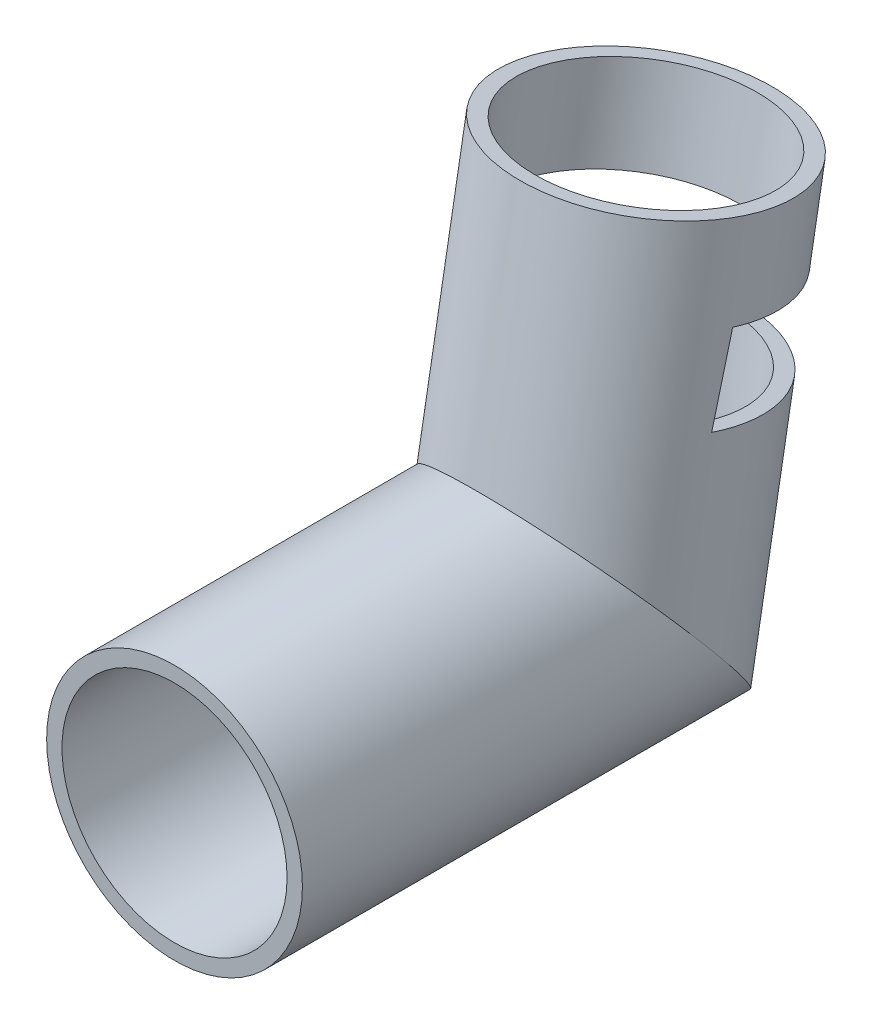
ISO-10303-21;
HEADER;
FILE_DESCRIPTION(('STEP AP214'),'2;1');
FILE_NAME('part.step','',(''),(''),'','','');
FILE_SCHEMA(('AUTOMOTIVE_DESIGN { 1 0 10303 214 1 1 1 1 }'));
ENDSEC;
DATA;
#1=APPLICATION_CONTEXT('core data for automotive mechanical design processes');
#2=APPLICATION_PROTOCOL_DEFINITION('international standard','automotive_design',2000,#1);
#3=PRODUCT_CONTEXT('',#1,'mechanical');
#4=PRODUCT('Part','Part','',(#3));
#5=PRODUCT_RELATED_PRODUCT_CATEGORY('part','',(#4));
#6=PRODUCT_DEFINITION_FORMATION('','',#4);
#7=PRODUCT_DEFINITION_CONTEXT('part definition',#1,'design');
#8=PRODUCT_DEFINITION('design','',#6,#7);
#9=PRODUCT_DEFINITION_SHAPE('','',#8);
#10=(LENGTH_UNIT() NAMED_UNIT(*) SI_UNIT(.MILLI.,.METRE.));
#11=(NAMED_UNIT(*) PLANE_ANGLE_UNIT() SI_UNIT($,.RADIAN.));
#12=(NAMED_UNIT(*) SI_UNIT($,.STERADIAN.) SOLID_ANGLE_UNIT());
#13=UNCERTAINTY_MEASURE_WITH_UNIT(LENGTH_MEASURE(1.E-05),#10,'distance_accuracy_value','');
#14=(GEOMETRIC_REPRESENTATION_CONTEXT(3) GLOBAL_UNCERTAINTY_ASSIGNED_CONTEXT((#13)) GLOBAL_UNIT_ASSIGNED_CONTEXT((#10,
#11,#12)) REPRESENTATION_CONTEXT('',''));
#15=CARTESIAN_POINT('',(0.,0.,0.));
#16=DIRECTION('',(0.,0.,1.));
#17=DIRECTION('',(1.,0.,0.));
#18=AXIS2_PLACEMENT_3D('',#15,#16,#17);
#19=CARTESIAN_POINT('',(0.,-40.0939089762223,-72.9303620854231));
#20=DIRECTION('',(0.,0.98480775301221,-0.17364817766692));
#21=DIRECTION('',(0.,0.17364817766692,0.98480775301221));
#22=AXIS2_PLACEMENT_3D('',#19,#20,#21);
#23=CYLINDRICAL_SURFACE('',#22,22.);
#24=CARTESIAN_POINT('',(0.,68.9365427108547,-92.1553724366844));
#25=DIRECTION('',(0.,-0.98480775301221,0.17364817766692));
#26=DIRECTION('',(1.,0.,0.));
#27=AXIS2_PLACEMENT_3D('',#24,#25,#26);
#28=CIRCLE('',#27,22.);
#29=CARTESIAN_POINT('',(22.,68.9365427108547,-92.1553724366844));
#30=VERTEX_POINT('',#29);
#31=EDGE_CURVE('E102',#30,#30,#28,.F.);
#32=ORIENTED_EDGE('',*,*,#31,.T.);
#33=EDGE_LOOP('',(#32));
#34=FACE_BOUND('',#33,.T.);
#35=CARTESIAN_POINT('',(0.,0.,-80.));
#36=DIRECTION('',(0.,0.642787609686543,-0.766044443118975));
#37=DIRECTION('',(0.,-0.766044443118975,-0.642787609686543));
#38=AXIS2_PLACEMENT_3D('',#35,#36,#37);
#39=ELLIPSE('',#38,28.7189603653103,22.);
#40=CARTESIAN_POINT('',(0.,-22.,-98.4601918859004));
#41=VERTEX_POINT('',#40);
#42=EDGE_CURVE('E90',#41,#41,#39,.F.);
#43=ORIENTED_EDGE('',*,*,#42,.T.);
#44=EDGE_LOOP('',(#43));
#45=FACE_BOUND('',#44,.T.);
#46=CARTESIAN_POINT('',(0.,122.72140743661,-101.63909524159));
#47=DIRECTION('',(0.,-0.235906352108225,-0.971775793604157));
#48=DIRECTION('',(0.,0.971775793604158,-0.235906352108225));
#49=AXIS2_PLACEMENT_3D('',#46,#47,#48);
#50=ELLIPSE('',#49,346.046293557792,22.);
#51=CARTESIAN_POINT('',(-21.511110706218,52.2224091574978,-84.5248991268385));
#52=VERTEX_POINT('',#51);
#53=CARTESIAN_POINT('',(-21.2605618337633,36.2694945527524,-80.6522014174814));
#54=VERTEX_POINT('',#53);
#55=EDGE_CURVE('E11',#52,#54,#50,.F.);
#56=ORIENTED_EDGE('',*,*,#55,.F.);
#57=CARTESIAN_POINT('',(0.,51.4215141651783,-89.0670003362029));
#58=DIRECTION('',(0.,0.98480775301221,-0.17364817766692));
#59=DIRECTION('',(0.,0.17364817766692,0.98480775301221));
#60=AXIS2_PLACEMENT_3D('',#57,#58,#59);
#61=CIRCLE('',#60,22.);
#62=CARTESIAN_POINT('',(21.511110706218,52.2224091574978,-84.5248991268385));
#63=VERTEX_POINT('',#62);
#64=EDGE_CURVE('E37',#52,#63,#61,.F.);
#65=ORIENTED_EDGE('',*,*,#64,.T.);
#66=CARTESIAN_POINT('',(21.2605618337632,36.2694945527524,-80.6522014174814));
#67=VERTEX_POINT('',#66);
#68=EDGE_CURVE('E43',#67,#63,#50,.F.);
#69=ORIENTED_EDGE('',*,*,#68,.F.);
#70=CARTESIAN_POINT('',(0.,35.2873684829464,-86.2221151417446));
#71=DIRECTION('',(0.,-0.98480775301221,0.17364817766692));
#72=DIRECTION('',(0.,-0.17364817766692,-0.98480775301221));
#73=AXIS2_PLACEMENT_3D('',#70,#71,#72);
#74=CIRCLE('',#73,22.);
#75=EDGE_CURVE('E86',#67,#54,#74,.F.);
#76=ORIENTED_EDGE('',*,*,#75,.T.);
#77=EDGE_LOOP('',(#56,#65,#69,#76));
#78=FACE_BOUND('',#77,.T.);
#79=ADVANCED_FACE('F33',(#34,#45,#78),#23,.F.);
#80=CARTESIAN_POINT('',(0.,-45.5478310036206,-71.9686884813127));
#81=DIRECTION('',(0.,0.98480775301221,-0.17364817766692));
#82=DIRECTION('',(0.,0.17364817766692,0.98480775301221));
#83=AXIS2_PLACEMENT_3D('',#80,#81,#82);
#84=CYLINDRICAL_SURFACE('',#83,25.);
#85=CARTESIAN_POINT('',(0.,122.72140743661,-101.63909524159));
#86=DIRECTION('',(0.,-0.235906352108225,-0.971775793604157));
#87=DIRECTION('',(0.,0.971775793604158,-0.235906352108225));
#88=AXIS2_PLACEMENT_3D('',#85,#86,#87);
#89=ELLIPSE('',#88,393.234424497491,25.);
#90=CARTESIAN_POINT('',(-24.3518272309753,36.2694945527524,-80.6522014174814));
#91=VERTEX_POINT('',#90);
#92=CARTESIAN_POINT('',(-24.5708747059434,52.2224091574978,-84.5248991268385));
#93=VERTEX_POINT('',#92);
#94=EDGE_CURVE('E88',#91,#93,#89,.T.);
#95=ORIENTED_EDGE('',*,*,#94,.F.);
#96=CARTESIAN_POINT('',(0.,35.2873684829465,-86.2221151417446));
#97=DIRECTION('',(0.,-0.98480775301221,0.17364817766692));
#98=DIRECTION('',(0.,-0.17364817766692,-0.98480775301221));
#99=AXIS2_PLACEMENT_3D('',#96,#97,#98);
#100=CIRCLE('',#99,25.);
#101=CARTESIAN_POINT('',(24.3518272309753,36.2694945527524,-80.6522014174814));
#102=VERTEX_POINT('',#101);
#103=EDGE_CURVE('E50',#91,#102,#100,.T.);
#104=ORIENTED_EDGE('',*,*,#103,.T.);
#105=CARTESIAN_POINT('',(24.5708747059433,52.2224091574978,-84.5248991268385));
#106=VERTEX_POINT('',#105);
#107=EDGE_CURVE('E112',#106,#102,#89,.T.);
#108=ORIENTED_EDGE('',*,*,#107,.F.);
#109=CARTESIAN_POINT('',(0.,51.4215141651783,-89.0670003362029));
#110=DIRECTION('',(0.,0.98480775301221,-0.17364817766692));
#111=DIRECTION('',(0.,0.17364817766692,0.98480775301221));
#112=AXIS2_PLACEMENT_3D('',#109,#110,#111);
#113=CIRCLE('',#112,25.);
#114=EDGE_CURVE('E96',#106,#93,#113,.T.);
#115=ORIENTED_EDGE('',*,*,#114,.T.);
#116=EDGE_LOOP('',(#95,#104,#108,#115));
#117=FACE_BOUND('',#116,.T.);
#118=CARTESIAN_POINT('',(0.,0.,-80.));
#119=DIRECTION('',(0.,0.642787609686543,-0.766044443118975));
#120=DIRECTION('',(0.,-0.766044443118975,-0.642787609686543));
#121=AXIS2_PLACEMENT_3D('',#118,#119,#120);
#122=ELLIPSE('',#121,32.6351822333071,25.);
#123=CARTESIAN_POINT('',(0.,-25.,-100.977490779432));
#124=VERTEX_POINT('',#123);
#125=EDGE_CURVE('E92',#124,#124,#122,.T.);
#126=ORIENTED_EDGE('',*,*,#125,.T.);
#127=EDGE_LOOP('',(#126));
#128=FACE_BOUND('',#127,.T.);
#129=CARTESIAN_POINT('',(0.,68.9365427108547,-92.1553724366844));
#130=DIRECTION('',(0.,-0.98480775301221,0.17364817766692));
#131=DIRECTION('',(1.,0.,0.));
#132=AXIS2_PLACEMENT_3D('',#129,#130,#131);
#133=CIRCLE('',#132,25.);
#134=CARTESIAN_POINT('',(25.,68.9365427108547,-92.1553724366844));
#135=VERTEX_POINT('',#134);
#136=EDGE_CURVE('E95',#135,#135,#133,.T.);
#137=ORIENTED_EDGE('',*,*,#136,.T.);
#138=EDGE_LOOP('',(#137));
#139=FACE_BOUND('',#138,.T.);
#140=ADVANCED_FACE('F35',(#117,#128,#139),#84,.T.);
#141=CARTESIAN_POINT('',(0.,0.,0.));
#142=DIRECTION('',(0.,0.,-1.));
#143=DIRECTION('',(-1.,0.,0.));
#144=AXIS2_PLACEMENT_3D('',#141,#142,#143);
#145=CYLINDRICAL_SURFACE('',#144,25.);
#146=CARTESIAN_POINT('',(0.,0.,0.));
#147=DIRECTION('',(0.,0.,1.));
#148=DIRECTION('',(1.,0.,0.));
#149=AXIS2_PLACEMENT_3D('',#146,#147,#148);
#150=CIRCLE('',#149,25.);
#151=CARTESIAN_POINT('',(25.,0.,0.));
#152=VERTEX_POINT('',#151);
#153=EDGE_CURVE('E99',#152,#152,#150,.T.);
#154=ORIENTED_EDGE('',*,*,#153,.F.);
#155=EDGE_LOOP('',(#154));
#156=FACE_BOUND('',#155,.T.);
#157=ORIENTED_EDGE('',*,*,#125,.F.);
#158=EDGE_LOOP('',(#157));
#159=FACE_BOUND('',#158,.T.);
#160=ADVANCED_FACE('F136',(#156,#159),#145,.T.);
#161=CARTESIAN_POINT('',(0.,68.9365427108547,-92.1553724366844));
#162=DIRECTION('',(0.,-0.98480775301221,0.17364817766692));
#163=DIRECTION('',(1.,0.,0.));
#164=AXIS2_PLACEMENT_3D('',#161,#162,#163);
#165=PLANE('',#164);
#166=ORIENTED_EDGE('',*,*,#31,.F.);
#167=EDGE_LOOP('',(#166));
#168=FACE_BOUND('',#167,.T.);
#169=ORIENTED_EDGE('',*,*,#136,.F.);
#170=EDGE_LOOP('',(#169));
#171=FACE_BOUND('',#170,.T.);
#172=ADVANCED_FACE('F146',(#168,#171),#165,.F.);
#173=CARTESIAN_POINT('',(0.,0.,0.));
#174=DIRECTION('',(0.,0.,1.));
#175=DIRECTION('',(1.,0.,0.));
#176=AXIS2_PLACEMENT_3D('',#173,#174,#175);
#177=PLANE('',#176);
#178=CARTESIAN_POINT('',(0.,0.,0.));
#179=DIRECTION('',(0.,0.,1.));
#180=DIRECTION('',(1.,0.,0.));
#181=AXIS2_PLACEMENT_3D('',#178,#179,#180);
#182=CIRCLE('',#181,22.);
#183=CARTESIAN_POINT('',(22.,0.,0.));
#184=VERTEX_POINT('',#183);
#185=EDGE_CURVE('E105',#184,#184,#182,.F.);
#186=ORIENTED_EDGE('',*,*,#185,.T.);
#187=EDGE_LOOP('',(#186));
#188=FACE_BOUND('',#187,.T.);
#189=ORIENTED_EDGE('',*,*,#153,.T.);
#190=EDGE_LOOP('',(#189));
#191=FACE_BOUND('',#190,.T.);
#192=ADVANCED_FACE('F131',(#188,#191),#177,.T.);
#193=CARTESIAN_POINT('',(0.,0.,0.));
#194=DIRECTION('',(0.,0.,-1.));
#195=DIRECTION('',(-1.,0.,0.));
#196=AXIS2_PLACEMENT_3D('',#193,#194,#195);
#197=CYLINDRICAL_SURFACE('',#196,22.);
#198=ORIENTED_EDGE('',*,*,#185,.F.);
#199=EDGE_LOOP('',(#198));
#200=FACE_BOUND('',#199,.T.);
#201=ORIENTED_EDGE('',*,*,#42,.F.);
#202=EDGE_LOOP('',(#201));
#203=FACE_BOUND('',#202,.T.);
#204=ADVANCED_FACE('F124',(#200,#203),#197,.F.);
#205=CARTESIAN_POINT('',(-25.,65.1023198982043,-11.4792955047663));
#206=DIRECTION('',(0.,0.98480775301221,-0.17364817766692));
#207=DIRECTION('',(0.,0.17364817766692,0.98480775301221));
#208=AXIS2_PLACEMENT_3D('',#205,#206,#207);
#209=PLANE('',#208);
#210=DIRECTION('',(1.,0.,0.));
#211=VECTOR('',#210,1.);
#212=CARTESIAN_POINT('',(-25.,52.2224091574978,-84.5248991268385));
#213=LINE('',#212,#211);
#214=EDGE_CURVE('E114',#63,#106,#213,.T.);
#215=ORIENTED_EDGE('',*,*,#214,.F.);
#216=ORIENTED_EDGE('',*,*,#64,.F.);
#217=EDGE_CURVE('E81',#93,#52,#213,.T.);
#218=ORIENTED_EDGE('',*,*,#217,.F.);
#219=ORIENTED_EDGE('',*,*,#114,.F.);
#220=EDGE_LOOP('',(#215,#216,#218,#219));
#221=FACE_BOUND('',#220,.T.);
#222=ADVANCED_FACE('F122',(#221),#209,.F.);
#223=CARTESIAN_POINT('',(-25.,48.9681742159724,-8.63441031030796));
#224=DIRECTION('',(0.,-0.98480775301221,0.17364817766692));
#225=DIRECTION('',(0.,-0.17364817766692,-0.98480775301221));
#226=AXIS2_PLACEMENT_3D('',#223,#224,#225);
#227=PLANE('',#226);
#228=ORIENTED_EDGE('',*,*,#103,.F.);
#229=DIRECTION('',(1.,0.,0.));
#230=VECTOR('',#229,1.);
#231=CARTESIAN_POINT('',(-25.,36.2694945527524,-80.6522014174814));
#232=LINE('',#231,#230);
#233=EDGE_CURVE('E78',#91,#54,#232,.T.);
#234=ORIENTED_EDGE('',*,*,#233,.T.);
#235=ORIENTED_EDGE('',*,*,#75,.F.);
#236=EDGE_CURVE('E57',#67,#102,#232,.T.);
#237=ORIENTED_EDGE('',*,*,#236,.T.);
#238=EDGE_LOOP('',(#228,#234,#235,#237));
#239=FACE_BOUND('',#238,.T.);
#240=ADVANCED_FACE('F85',(#239),#227,.F.);
#241=CARTESIAN_POINT('',(-25.,-16.4708996177153,-67.8490485921158));
#242=DIRECTION('',(0.,-0.235906352108225,-0.971775793604157));
#243=DIRECTION('',(0.,0.971775793604158,-0.235906352108225));
#244=AXIS2_PLACEMENT_3D('',#241,#242,#243);
#245=PLANE('',#244);
#246=ORIENTED_EDGE('',*,*,#107,.T.);
#247=ORIENTED_EDGE('',*,*,#236,.F.);
#248=ORIENTED_EDGE('',*,*,#68,.T.);
#249=ORIENTED_EDGE('',*,*,#214,.T.);
#250=EDGE_LOOP('',(#246,#247,#248,#249));
#251=FACE_BOUND('',#250,.T.);
#252=ADVANCED_FACE('F118',(#251),#245,.T.);
#253=ORIENTED_EDGE('',*,*,#94,.T.);
#254=ORIENTED_EDGE('',*,*,#217,.T.);
#255=ORIENTED_EDGE('',*,*,#55,.T.);
#256=ORIENTED_EDGE('',*,*,#233,.F.);
#257=EDGE_LOOP('',(#253,#254,#255,#256));
#258=FACE_BOUND('',#257,.T.);
#259=ADVANCED_FACE('F77',(#258),#245,.T.);
#260=CLOSED_SHELL('',(#79,#140,#160,#172,#192,#204,#222,#240,#252,#259));
#261=MANIFOLD_SOLID_BREP('B2',#260);
#262=ADVANCED_BREP_SHAPE_REPRESENTATION('',(#18,#261),#14);
#263=SHAPE_DEFINITION_REPRESENTATION(#9,#262);
ENDSEC;
END-ISO-10303-21;
